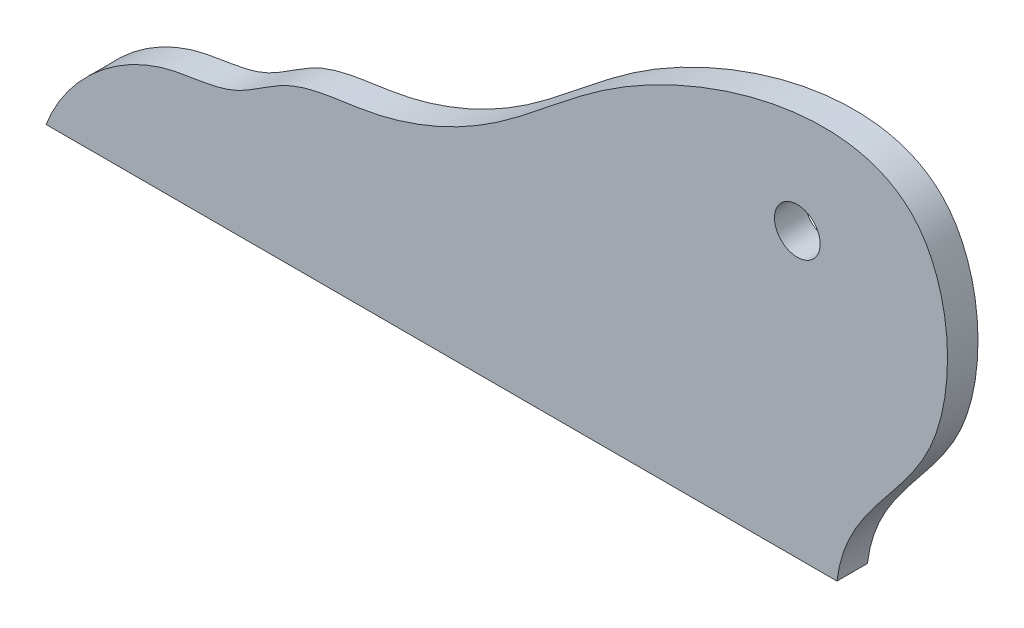
ISO-10303-21;
HEADER;
FILE_DESCRIPTION(('STEP AP214'),'2;1');
FILE_NAME('part.step','',(''),(''),'','','');
FILE_SCHEMA(('AUTOMOTIVE_DESIGN { 1 0 10303 214 1 1 1 1 }'));
ENDSEC;
DATA;
#1=APPLICATION_CONTEXT('core data for automotive mechanical design processes');
#2=APPLICATION_PROTOCOL_DEFINITION('international standard','automotive_design',2000,#1);
#3=PRODUCT_CONTEXT('',#1,'mechanical');
#4=PRODUCT('Part','Part','',(#3));
#5=PRODUCT_RELATED_PRODUCT_CATEGORY('part','',(#4));
#6=PRODUCT_DEFINITION_FORMATION('','',#4);
#7=PRODUCT_DEFINITION_CONTEXT('part definition',#1,'design');
#8=PRODUCT_DEFINITION('design','',#6,#7);
#9=PRODUCT_DEFINITION_SHAPE('','',#8);
#10=(LENGTH_UNIT() NAMED_UNIT(*) SI_UNIT(.MILLI.,.METRE.));
#11=(NAMED_UNIT(*) PLANE_ANGLE_UNIT() SI_UNIT($,.RADIAN.));
#12=(NAMED_UNIT(*) SI_UNIT($,.STERADIAN.) SOLID_ANGLE_UNIT());
#13=UNCERTAINTY_MEASURE_WITH_UNIT(LENGTH_MEASURE(1.E-05),#10,'distance_accuracy_value','');
#14=(GEOMETRIC_REPRESENTATION_CONTEXT(3) GLOBAL_UNCERTAINTY_ASSIGNED_CONTEXT((#13)) GLOBAL_UNIT_ASSIGNED_CONTEXT((#10,
#11,#12)) REPRESENTATION_CONTEXT('',''));
#15=CARTESIAN_POINT('',(0.,0.,0.));
#16=DIRECTION('',(0.,0.,1.));
#17=DIRECTION('',(1.,0.,0.));
#18=AXIS2_PLACEMENT_3D('',#15,#16,#17);
#19=CARTESIAN_POINT('',(380.517360948955,50.4243232189049,3.175));
#20=DIRECTION('',(0.,0.,1.));
#21=DIRECTION('',(1.,0.,0.));
#22=AXIS2_PLACEMENT_3D('',#19,#20,#21);
#23=PLANE('',#22);
#24=CARTESIAN_POINT('',(402.95315144446,17.0631905577608,3.175));
#25=CARTESIAN_POINT('',(403.823403650514,24.424378094994,3.175));
#26=CARTESIAN_POINT('',(415.988761743829,31.2995700632092,3.175));
#27=CARTESIAN_POINT('',(414.277353482889,63.7017324506292,3.175));
#28=CARTESIAN_POINT('',(381.865472250887,53.8621406864556,3.175));
#29=CARTESIAN_POINT('',(368.371006485313,40.2422362870502,3.175));
#30=CARTESIAN_POINT('',(356.08721707672,34.6665749399129,3.175));
#31=CARTESIAN_POINT('',(346.034342646207,34.2898277399479,3.175));
#32=CARTESIAN_POINT('',(340.181861619828,29.1026992950649,3.175));
#33=CARTESIAN_POINT('',(329.569431560471,28.8033232209982,3.175));
#34=CARTESIAN_POINT('',(322.6027473718,22.4220708459021,3.175));
#35=CARTESIAN_POINT('',(320.529135655299,17.0631905577608,3.175));
#36=B_SPLINE_CURVE_WITH_KNOTS('',3,(#24,#25,#26,#27,#28,#29,#30,#31,#32,#33,#34,#35),
.UNSPECIFIED.,.F.,.F.,(4,1,1,1,1,1,1,1,1,4),(0.,0.139515123859717,0.281339692293873,
0.503759449284065,0.619477586670284,0.718457415856793,0.780256271711831,0.827734461509517,
0.8759600286338,1.),.UNSPECIFIED.);
#37=CARTESIAN_POINT('',(402.95315144446,17.0631905577608,3.175));
#38=VERTEX_POINT('',#37);
#39=CARTESIAN_POINT('',(320.529135655299,17.0631905577608,3.175));
#40=VERTEX_POINT('',#39);
#41=EDGE_CURVE('E64',#38,#40,#36,.T.);
#42=ORIENTED_EDGE('',*,*,#41,.T.);
#43=DIRECTION('',(1.,0.,0.));
#44=VECTOR('',#43,1.);
#45=CARTESIAN_POINT('',(320.529135655299,17.0631905577608,3.175));
#46=LINE('',#45,#44);
#47=EDGE_CURVE('E49',#40,#38,#46,.T.);
#48=ORIENTED_EDGE('',*,*,#47,.T.);
#49=EDGE_LOOP('',(#42,#48));
#50=FACE_BOUND('',#49,.T.);
#51=CARTESIAN_POINT('',(398.821621830968,46.603627294227,3.175));
#52=DIRECTION('',(0.,0.,1.));
#53=DIRECTION('',(1.,0.,0.));
#54=AXIS2_PLACEMENT_3D('',#51,#52,#53);
#55=CIRCLE('',#54,2.38125);
#56=CARTESIAN_POINT('',(401.202871830968,46.603627294227,3.175));
#57=VERTEX_POINT('',#56);
#58=EDGE_CURVE('E70',#57,#57,#55,.T.);
#59=ORIENTED_EDGE('',*,*,#58,.F.);
#60=EDGE_LOOP('',(#59));
#61=FACE_BOUND('',#60,.T.);
#62=ADVANCED_FACE('F32',(#50,#61),#23,.T.);
#63=CARTESIAN_POINT('',(380.517360948955,50.4243232189049,0.));
#64=DIRECTION('',(0.,0.,1.));
#65=DIRECTION('',(1.,0.,0.));
#66=AXIS2_PLACEMENT_3D('',#63,#64,#65);
#67=PLANE('',#66);
#68=CARTESIAN_POINT('',(402.95315144446,17.0631905577608,0.));
#69=CARTESIAN_POINT('',(403.823403650514,24.424378094994,0.));
#70=CARTESIAN_POINT('',(415.988761743829,31.2995700632092,0.));
#71=CARTESIAN_POINT('',(414.277353482889,63.7017324506292,0.));
#72=CARTESIAN_POINT('',(381.865472250887,53.8621406864556,0.));
#73=CARTESIAN_POINT('',(368.371006485313,40.2422362870502,0.));
#74=CARTESIAN_POINT('',(356.08721707672,34.6665749399129,0.));
#75=CARTESIAN_POINT('',(346.034342646207,34.2898277399479,0.));
#76=CARTESIAN_POINT('',(340.181861619828,29.1026992950649,0.));
#77=CARTESIAN_POINT('',(329.569431560471,28.8033232209982,0.));
#78=CARTESIAN_POINT('',(322.6027473718,22.4220708459021,0.));
#79=CARTESIAN_POINT('',(320.529135655299,17.0631905577608,0.));
#80=B_SPLINE_CURVE_WITH_KNOTS('',3,(#68,#69,#70,#71,#72,#73,#74,#75,#76,#77,#78,#79),
.UNSPECIFIED.,.F.,.F.,(4,1,1,1,1,1,1,1,1,4),(0.,0.139515123859717,0.281339692293873,
0.503759449284065,0.619477586670284,0.718457415856793,0.780256271711831,0.827734461509517,
0.8759600286338,1.),.UNSPECIFIED.);
#81=CARTESIAN_POINT('',(402.95315144446,17.0631905577608,0.));
#82=VERTEX_POINT('',#81);
#83=CARTESIAN_POINT('',(320.529135655299,17.0631905577608,0.));
#84=VERTEX_POINT('',#83);
#85=EDGE_CURVE('E65',#82,#84,#80,.T.);
#86=ORIENTED_EDGE('',*,*,#85,.F.);
#87=DIRECTION('',(1.,0.,0.));
#88=VECTOR('',#87,1.);
#89=CARTESIAN_POINT('',(320.529135655299,17.0631905577608,0.));
#90=LINE('',#89,#88);
#91=EDGE_CURVE('E57',#84,#82,#90,.T.);
#92=ORIENTED_EDGE('',*,*,#91,.F.);
#93=EDGE_LOOP('',(#86,#92));
#94=FACE_BOUND('',#93,.T.);
#95=CARTESIAN_POINT('',(398.821621830968,46.603627294227,0.));
#96=DIRECTION('',(0.,0.,1.));
#97=DIRECTION('',(1.,0.,0.));
#98=AXIS2_PLACEMENT_3D('',#95,#96,#97);
#99=CIRCLE('',#98,2.38125);
#100=CARTESIAN_POINT('',(401.202871830968,46.603627294227,0.));
#101=VERTEX_POINT('',#100);
#102=EDGE_CURVE('E73',#101,#101,#99,.T.);
#103=ORIENTED_EDGE('',*,*,#102,.T.);
#104=EDGE_LOOP('',(#103));
#105=FACE_BOUND('',#104,.T.);
#106=ADVANCED_FACE('F68',(#94,#105),#67,.F.);
#107=DIRECTION('',(0.,0.,-1.));
#108=VECTOR('',#107,1.);
#109=SURFACE_OF_LINEAR_EXTRUSION('',#36,#108);
#110=ORIENTED_EDGE('',*,*,#85,.T.);
#111=DIRECTION('',(0.,0.,-1.));
#112=VECTOR('',#111,1.);
#113=CARTESIAN_POINT('',(320.529135655299,17.0631905577608,3.175));
#114=LINE('',#113,#112);
#115=EDGE_CURVE('E11',#40,#84,#114,.T.);
#116=ORIENTED_EDGE('',*,*,#115,.F.);
#117=ORIENTED_EDGE('',*,*,#41,.F.);
#118=DIRECTION('',(0.,0.,-1.));
#119=VECTOR('',#118,1.);
#120=CARTESIAN_POINT('',(402.95315144446,17.0631905577608,3.175));
#121=LINE('',#120,#119);
#122=EDGE_CURVE('E42',#38,#82,#121,.T.);
#123=ORIENTED_EDGE('',*,*,#122,.T.);
#124=EDGE_LOOP('',(#110,#116,#117,#123));
#125=FACE_BOUND('',#124,.T.);
#126=ADVANCED_FACE('F34',(#125),#109,.F.);
#127=CARTESIAN_POINT('',(320.529135655299,17.0631905577608,3.175));
#128=DIRECTION('',(0.,1.,0.));
#129=DIRECTION('',(0.,0.,1.));
#130=AXIS2_PLACEMENT_3D('',#127,#128,#129);
#131=PLANE('',#130);
#132=ORIENTED_EDGE('',*,*,#91,.T.);
#133=ORIENTED_EDGE('',*,*,#122,.F.);
#134=ORIENTED_EDGE('',*,*,#47,.F.);
#135=ORIENTED_EDGE('',*,*,#115,.T.);
#136=EDGE_LOOP('',(#132,#133,#134,#135));
#137=FACE_BOUND('',#136,.T.);
#138=ADVANCED_FACE('F60',(#137),#131,.F.);
#139=CARTESIAN_POINT('',(398.821621830968,46.603627294227,3.175));
#140=DIRECTION('',(0.,0.,-1.));
#141=DIRECTION('',(-1.,0.,0.));
#142=AXIS2_PLACEMENT_3D('',#139,#140,#141);
#143=CYLINDRICAL_SURFACE('',#142,2.38125);
#144=ORIENTED_EDGE('',*,*,#58,.T.);
#145=EDGE_LOOP('',(#144));
#146=FACE_BOUND('',#145,.T.);
#147=ORIENTED_EDGE('',*,*,#102,.F.);
#148=EDGE_LOOP('',(#147));
#149=FACE_BOUND('',#148,.T.);
#150=ADVANCED_FACE('F91',(#146,#149),#143,.F.);
#151=CLOSED_SHELL('',(#62,#106,#126,#138,#150));
#152=MANIFOLD_SOLID_BREP('B2',#151);
#153=ADVANCED_BREP_SHAPE_REPRESENTATION('',(#18,#152),#14);
#154=SHAPE_DEFINITION_REPRESENTATION(#9,#153);
ENDSEC;
END-ISO-10303-21;
